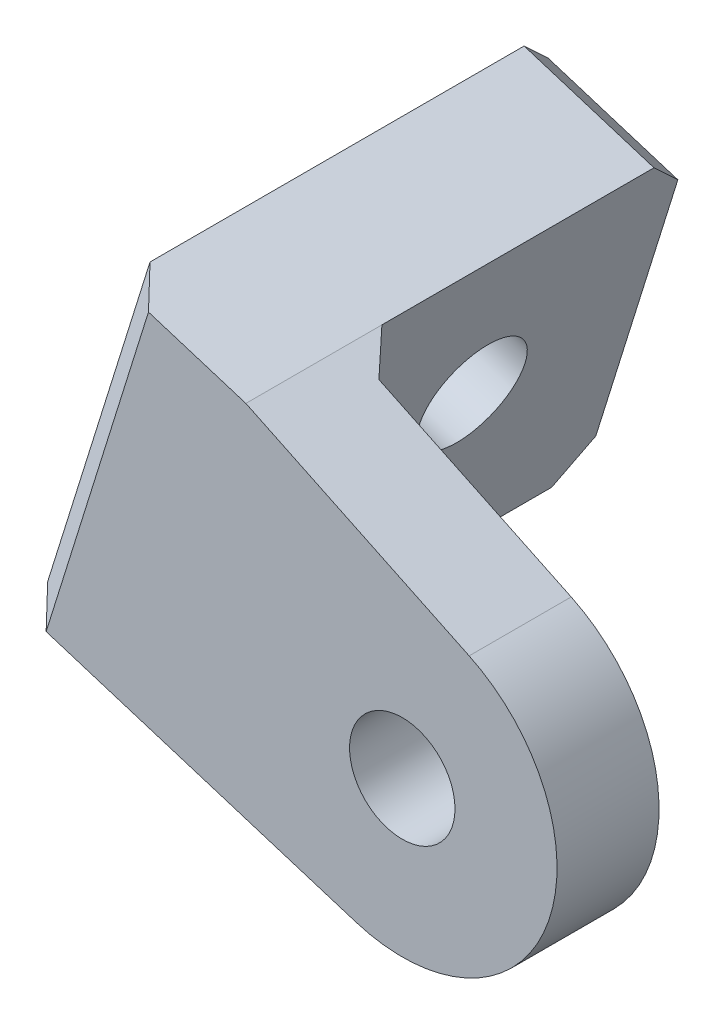
ISO-10303-21;
HEADER;
FILE_DESCRIPTION(('STEP AP214'),'2;1');
FILE_NAME('part.step','',(''),(''),'','','');
FILE_SCHEMA(('AUTOMOTIVE_DESIGN { 1 0 10303 214 1 1 1 1 }'));
ENDSEC;
DATA;
#1=APPLICATION_CONTEXT('core data for automotive mechanical design processes');
#2=APPLICATION_PROTOCOL_DEFINITION('international standard','automotive_design',2000,#1);
#3=PRODUCT_CONTEXT('',#1,'mechanical');
#4=PRODUCT('Part','Part','',(#3));
#5=PRODUCT_RELATED_PRODUCT_CATEGORY('part','',(#4));
#6=PRODUCT_DEFINITION_FORMATION('','',#4);
#7=PRODUCT_DEFINITION_CONTEXT('part definition',#1,'design');
#8=PRODUCT_DEFINITION('design','',#6,#7);
#9=PRODUCT_DEFINITION_SHAPE('','',#8);
#10=(LENGTH_UNIT() NAMED_UNIT(*) SI_UNIT(.MILLI.,.METRE.));
#11=(NAMED_UNIT(*) PLANE_ANGLE_UNIT() SI_UNIT($,.RADIAN.));
#12=(NAMED_UNIT(*) SI_UNIT($,.STERADIAN.) SOLID_ANGLE_UNIT());
#13=UNCERTAINTY_MEASURE_WITH_UNIT(LENGTH_MEASURE(1.E-05),#10,'distance_accuracy_value','');
#14=(GEOMETRIC_REPRESENTATION_CONTEXT(3) GLOBAL_UNCERTAINTY_ASSIGNED_CONTEXT((#13)) GLOBAL_UNIT_ASSIGNED_CONTEXT((#10,
#11,#12)) REPRESENTATION_CONTEXT('',''));
#15=CARTESIAN_POINT('',(0.,0.,0.));
#16=DIRECTION('',(0.,0.,1.));
#17=DIRECTION('',(1.,0.,0.));
#18=AXIS2_PLACEMENT_3D('',#15,#16,#17);
#19=CARTESIAN_POINT('',(12.6458721758377,26.3905196953717,-3.));
#20=DIRECTION('',(0.432131708683439,0.90181050467952,0.));
#21=DIRECTION('',(-0.90181050467952,0.43213170868344,0.));
#22=AXIS2_PLACEMENT_3D('',#19,#20,#21);
#23=PLANE('',#22);
#24=DIRECTION('',(0.90181050467952,-0.432131708683439,0.));
#25=VECTOR('',#24,1.);
#26=CARTESIAN_POINT('',(12.6458721758377,26.3905196953717,0.));
#27=LINE('',#26,#25);
#28=CARTESIAN_POINT('',(2.67565379619653,31.1680727200756,0.));
#29=VERTEX_POINT('',#28);
#30=CARTESIAN_POINT('',(9.24108820924442,28.0220321977735,0.));
#31=VERTEX_POINT('',#30);
#32=EDGE_CURVE('E158',#29,#31,#27,.T.);
#33=ORIENTED_EDGE('',*,*,#32,.T.);
#34=DIRECTION('',(0.,0.,1.));
#35=VECTOR('',#34,1.);
#36=CARTESIAN_POINT('',(9.24108820924442,28.0220321977735,-3.));
#37=LINE('',#36,#35);
#38=CARTESIAN_POINT('',(9.24108820924442,28.0220321977735,-3.));
#39=VERTEX_POINT('',#38);
#40=EDGE_CURVE('E137',#39,#31,#37,.T.);
#41=ORIENTED_EDGE('',*,*,#40,.F.);
#42=DIRECTION('',(0.90181050467952,-0.432131708683439,0.));
#43=VECTOR('',#42,1.);
#44=CARTESIAN_POINT('',(12.6458721758377,26.3905196953717,-3.));
#45=LINE('',#44,#43);
#46=CARTESIAN_POINT('',(3.58694323926157,30.7313988710868,-3.));
#47=VERTEX_POINT('',#46);
#48=EDGE_CURVE('E125',#47,#39,#45,.T.);
#49=ORIENTED_EDGE('',*,*,#48,.F.);
#50=DIRECTION('',(0.64100135330547,-0.307156557430796,0.703400394006016));
#51=VECTOR('',#50,1.);
#52=CARTESIAN_POINT('',(3.33765436171891,30.8508537100461,-3.27355620043639));
#53=LINE('',#52,#51);
#54=CARTESIAN_POINT('',(2.67565379619653,31.1680727200756,-4.00000000000001));
#55=VERTEX_POINT('',#54);
#56=EDGE_CURVE('E207',#55,#47,#53,.T.);
#57=ORIENTED_EDGE('',*,*,#56,.F.);
#58=DIRECTION('',(0.,0.,1.));
#59=VECTOR('',#58,1.);
#60=CARTESIAN_POINT('',(2.67565379619653,31.1680727200756,-3.));
#61=LINE('',#60,#59);
#62=EDGE_CURVE('E149',#55,#29,#61,.T.);
#63=ORIENTED_EDGE('',*,*,#62,.T.);
#64=EDGE_LOOP('',(#33,#41,#49,#57,#63));
#65=FACE_BOUND('',#64,.T.);
#66=ADVANCED_FACE('F37',(#65),#23,.T.);
#67=CARTESIAN_POINT('',(9.10096871201294,29.1629022647186,-3.));
#68=DIRECTION('',(0.297904049493287,0.954595818813125,0.));
#69=DIRECTION('',(-0.954595818813125,0.297904049493287,0.));
#70=AXIS2_PLACEMENT_3D('',#67,#68,#69);
#71=PLANE('',#70);
#72=DIRECTION('',(0.954595818813125,-0.297904049493287,0.));
#73=VECTOR('',#72,1.);
#74=CARTESIAN_POINT('',(9.10096871201294,29.1629022647186,0.));
#75=LINE('',#74,#73);
#76=CARTESIAN_POINT('',(-0.188133660242845,32.0617848685554,0.));
#77=VERTEX_POINT('',#76);
#78=EDGE_CURVE('E161',#77,#29,#75,.T.);
#79=ORIENTED_EDGE('',*,*,#78,.T.);
#80=ORIENTED_EDGE('',*,*,#62,.F.);
#81=DIRECTION('',(0.,0.,1.));
#82=VECTOR('',#81,1.);
#83=CARTESIAN_POINT('',(2.67565379619653,31.1680727200756,-13.));
#84=LINE('',#83,#82);
#85=CARTESIAN_POINT('',(2.67565379619653,31.1680727200756,-12.));
#86=VERTEX_POINT('',#85);
#87=EDGE_CURVE('E189',#86,#55,#84,.T.);
#88=ORIENTED_EDGE('',*,*,#87,.F.);
#89=DIRECTION('',(0.954595818813125,-0.297904049493287,0.));
#90=VECTOR('',#89,1.);
#91=CARTESIAN_POINT('',(9.10096871201294,29.1629022647186,-12.));
#92=LINE('',#91,#90);
#93=CARTESIAN_POINT('',(-1.14272947905597,32.3596889180487,-12.));
#94=VERTEX_POINT('',#93);
#95=EDGE_CURVE('E200',#94,#86,#92,.T.);
#96=ORIENTED_EDGE('',*,*,#95,.F.);
#97=DIRECTION('',(0.,0.,1.));
#98=VECTOR('',#97,1.);
#99=CARTESIAN_POINT('',(-1.14272947905597,32.3596889180487,-3.));
#100=LINE('',#99,#98);
#101=CARTESIAN_POINT('',(-1.14272947905597,32.3596889180487,-1.));
#102=VERTEX_POINT('',#101);
#103=EDGE_CURVE('E170',#94,#102,#100,.T.);
#104=ORIENTED_EDGE('',*,*,#103,.T.);
#105=DIRECTION('',(-0.675001176775085,0.210649973539636,-0.707106781186549));
#106=VECTOR('',#105,1.);
#107=CARTESIAN_POINT('',(3.02452379766534,31.059199640877,3.36546357588553));
#108=LINE('',#107,#106);
#109=EDGE_CURVE('E213',#77,#102,#108,.T.);
#110=ORIENTED_EDGE('',*,*,#109,.F.);
#111=EDGE_LOOP('',(#79,#80,#88,#96,#104,#110));
#112=FACE_BOUND('',#111,.T.);
#113=ADVANCED_FACE('F235',(#112),#71,.T.);
#114=CARTESIAN_POINT('',(-10.2436981910689,3.19678665333007,-3.));
#115=DIRECTION('',(-0.954595818813125,0.297904049493287,0.));
#116=DIRECTION('',(-0.297904049493287,-0.954595818813125,0.));
#117=AXIS2_PLACEMENT_3D('',#114,#115,#116);
#118=PLANE('',#117);
#119=CARTESIAN_POINT('',(-2.54058132704005,27.8804496070172,-8.05588909029522));
#120=DIRECTION('',(0.954595818813125,-0.297904049493287,0.));
#121=DIRECTION('',(-3.01133376189992E-12,-9.64943787454371E-12,1.));
#122=AXIS2_PLACEMENT_3D('',#119,#120,#121);
#123=ELLIPSE('',#122,1.55,1.54999119407382);
#124=CARTESIAN_POINT('',(-2.54058132704471,27.8804496070023,-6.50588909029522));
#125=VERTEX_POINT('',#124);
#126=EDGE_CURVE('E244',#125,#125,#123,.T.);
#127=ORIENTED_EDGE('',*,*,#126,.T.);
#128=EDGE_LOOP('',(#127));
#129=FACE_BOUND('',#128,.T.);
#130=ORIENTED_EDGE('',*,*,#103,.F.);
#131=DIRECTION('',(-0.210649973539637,-0.675001176775088,-0.707106781186546));
#132=VECTOR('',#131,1.);
#133=CARTESIAN_POINT('',(-4.35264561234267,22.0739189703484,-22.7749999999883));
#134=LINE('',#133,#132);
#135=CARTESIAN_POINT('',(-1.44063352854926,31.4050930992356,-13.));
#136=VERTEX_POINT('',#135);
#137=EDGE_CURVE('E195',#136,#94,#134,.F.);
#138=ORIENTED_EDGE('',*,*,#137,.F.);
#139=DIRECTION('',(-0.297904049493287,-0.954595818813125,0.));
#140=VECTOR('',#139,1.);
#141=CARTESIAN_POINT('',(-1.14272947905597,32.3596889180487,-13.));
#142=LINE('',#141,#140);
#143=CARTESIAN_POINT('',(-3.85365632944488,23.6728669668493,-13.));
#144=VERTEX_POINT('',#143);
#145=EDGE_CURVE('E237',#136,#144,#142,.T.);
#146=ORIENTED_EDGE('',*,*,#145,.T.);
#147=DIRECTION('',(-0.210649973539636,-0.675001176775085,0.707106781186548));
#148=VECTOR('',#147,1.);
#149=CARTESIAN_POINT('',(-8.53819750772333,8.66184771602406,2.72499999998831));
#150=LINE('',#149,#148);
#151=CARTESIAN_POINT('',(-4.15156037893817,22.7182711480361,-12.));
#152=VERTEX_POINT('',#151);
#153=EDGE_CURVE('E197',#152,#144,#150,.F.);
#154=ORIENTED_EDGE('',*,*,#153,.F.);
#155=DIRECTION('',(0.,0.,1.));
#156=VECTOR('',#155,1.);
#157=CARTESIAN_POINT('',(-4.15156037893816,22.7182711480361,-3.));
#158=LINE('',#157,#156);
#159=CARTESIAN_POINT('',(-4.15156037893816,22.7182711480361,-1.));
#160=VERTEX_POINT('',#159);
#161=EDGE_CURVE('E136',#152,#160,#158,.T.);
#162=ORIENTED_EDGE('',*,*,#161,.T.);
#163=DIRECTION('',(-0.297904049493287,-0.954595818813125,0.));
#164=VECTOR('',#163,1.);
#165=CARTESIAN_POINT('',(-4.15156037893817,22.7182711480361,-1.));
#166=LINE('',#165,#164);
#167=EDGE_CURVE('E45',#102,#160,#166,.T.);
#168=ORIENTED_EDGE('',*,*,#167,.F.);
#169=EDGE_LOOP('',(#130,#138,#146,#154,#162,#168));
#170=FACE_BOUND('',#169,.T.);
#171=ADVANCED_FACE('F216',(#129,#170),#118,.T.);
#172=CARTESIAN_POINT('',(6.09213781213073,19.5214844947061,-3.));
#173=DIRECTION('',(-0.297904049493286,-0.954595818813125,0.));
#174=DIRECTION('',(0.954595818813126,-0.297904049493286,0.));
#175=AXIS2_PLACEMENT_3D('',#172,#173,#174);
#176=PLANE('',#175);
#177=ORIENTED_EDGE('',*,*,#161,.F.);
#178=DIRECTION('',(-0.954595818813126,0.297904049493286,0.));
#179=VECTOR('',#178,1.);
#180=CARTESIAN_POINT('',(6.09213781213073,19.5214844947061,-12.));
#181=LINE('',#180,#179);
#182=CARTESIAN_POINT('',(-0.333177103685661,21.526654950063,-12.));
#183=VERTEX_POINT('',#182);
#184=EDGE_CURVE('E193',#183,#152,#181,.T.);
#185=ORIENTED_EDGE('',*,*,#184,.F.);
#186=DIRECTION('',(0.,0.,1.));
#187=VECTOR('',#186,1.);
#188=CARTESIAN_POINT('',(-0.333177103685661,21.526654950063,-13.));
#189=LINE('',#188,#187);
#190=CARTESIAN_POINT('',(-0.333177103685661,21.526654950063,-4.00000000000001));
#191=VERTEX_POINT('',#190);
#192=EDGE_CURVE('E162',#183,#191,#189,.T.);
#193=ORIENTED_EDGE('',*,*,#192,.T.);
#194=DIRECTION('',(-0.675001176775082,0.210649973539634,-0.707106781186551));
#195=VECTOR('',#194,1.);
#196=CARTESIAN_POINT('',(-0.333177103685662,21.526654950063,-4.00000000000001));
#197=LINE('',#196,#195);
#198=CARTESIAN_POINT('',(0.621418715127459,21.2287509005697,-3.));
#199=VERTEX_POINT('',#198);
#200=EDGE_CURVE('E142',#199,#191,#197,.T.);
#201=ORIENTED_EDGE('',*,*,#200,.F.);
#202=DIRECTION('',(-0.954595818813126,0.297904049493286,0.));
#203=VECTOR('',#202,1.);
#204=CARTESIAN_POINT('',(6.09213781213073,19.5214844947061,-3.));
#205=LINE('',#204,#203);
#206=CARTESIAN_POINT('',(5.91942550954031,19.575383425882,-3.));
#207=VERTEX_POINT('',#206);
#208=EDGE_CURVE('E122',#207,#199,#205,.T.);
#209=ORIENTED_EDGE('',*,*,#208,.F.);
#210=DIRECTION('',(0.,0.,1.));
#211=VECTOR('',#210,1.);
#212=CARTESIAN_POINT('',(5.91942550954031,19.575383425882,-3.));
#213=LINE('',#212,#211);
#214=CARTESIAN_POINT('',(5.91942550954031,19.575383425882,0.));
#215=VERTEX_POINT('',#214);
#216=EDGE_CURVE('E132',#207,#215,#213,.T.);
#217=ORIENTED_EDGE('',*,*,#216,.T.);
#218=DIRECTION('',(-0.954595818813126,0.297904049493286,0.));
#219=VECTOR('',#218,1.);
#220=CARTESIAN_POINT('',(6.09213781213073,19.5214844947061,0.));
#221=LINE('',#220,#219);
#222=CARTESIAN_POINT('',(-3.19696456012504,22.4203670985429,0.));
#223=VERTEX_POINT('',#222);
#224=EDGE_CURVE('E164',#215,#223,#221,.T.);
#225=ORIENTED_EDGE('',*,*,#224,.T.);
#226=DIRECTION('',(0.675001176775085,-0.210649973539635,0.707106781186549));
#227=VECTOR('',#226,1.);
#228=CARTESIAN_POINT('',(0.0156928977831389,21.4177818708644,3.36546357588553));
#229=LINE('',#228,#227);
#230=EDGE_CURVE('E11',#160,#223,#229,.T.);
#231=ORIENTED_EDGE('',*,*,#230,.F.);
#232=EDGE_LOOP('',(#177,#185,#193,#201,#209,#217,#225,#231));
#233=FACE_BOUND('',#232,.T.);
#234=ADVANCED_FACE('F139',(#233),#176,.T.);
#235=CARTESIAN_POINT('',(7.27488893473476,23.9187944014817,-3.));
#236=DIRECTION('',(0.,0.,1.));
#237=DIRECTION('',(-1.,0.,0.));
#238=AXIS2_PLACEMENT_3D('',#235,#236,#237);
#239=CYLINDRICAL_SURFACE('',#238,4.55);
#240=CARTESIAN_POINT('',(7.27488893473476,23.9187944014817,0.));
#241=DIRECTION('',(0.,0.,1.));
#242=DIRECTION('',(1.,0.,0.));
#243=AXIS2_PLACEMENT_3D('',#240,#241,#242);
#244=CIRCLE('',#243,4.55);
#245=EDGE_CURVE('E134',#215,#31,#244,.T.);
#246=ORIENTED_EDGE('',*,*,#245,.F.);
#247=ORIENTED_EDGE('',*,*,#216,.F.);
#248=CARTESIAN_POINT('',(7.27488893473476,23.9187944014817,-3.));
#249=DIRECTION('',(0.,0.,1.));
#250=DIRECTION('',(1.,0.,0.));
#251=AXIS2_PLACEMENT_3D('',#248,#249,#250);
#252=CIRCLE('',#251,4.55);
#253=EDGE_CURVE('E117',#207,#39,#252,.T.);
#254=ORIENTED_EDGE('',*,*,#253,.T.);
#255=ORIENTED_EDGE('',*,*,#40,.T.);
#256=EDGE_LOOP('',(#246,#247,#254,#255));
#257=FACE_BOUND('',#256,.T.);
#258=ADVANCED_FACE('F133',(#257),#239,.T.);
#259=CARTESIAN_POINT('',(7.27488893473476,23.9187944014817,-3.));
#260=DIRECTION('',(0.,0.,1.));
#261=DIRECTION('',(-1.,0.,0.));
#262=AXIS2_PLACEMENT_3D('',#259,#260,#261);
#263=CYLINDRICAL_SURFACE('',#262,1.55);
#264=CARTESIAN_POINT('',(7.27488893473476,23.9187944014817,-3.));
#265=DIRECTION('',(0.,0.,1.));
#266=DIRECTION('',(1.,0.,0.));
#267=AXIS2_PLACEMENT_3D('',#264,#265,#266);
#268=CIRCLE('',#267,1.55);
#269=CARTESIAN_POINT('',(8.82488893473476,23.9187944014817,-3.));
#270=VERTEX_POINT('',#269);
#271=EDGE_CURVE('E129',#270,#270,#268,.T.);
#272=ORIENTED_EDGE('',*,*,#271,.F.);
#273=EDGE_LOOP('',(#272));
#274=FACE_BOUND('',#273,.T.);
#275=CARTESIAN_POINT('',(7.27488893473476,23.9187944014817,0.));
#276=DIRECTION('',(0.,0.,1.));
#277=DIRECTION('',(1.,0.,0.));
#278=AXIS2_PLACEMENT_3D('',#275,#276,#277);
#279=CIRCLE('',#278,1.55);
#280=CARTESIAN_POINT('',(8.82488893473476,23.9187944014817,0.));
#281=VERTEX_POINT('',#280);
#282=EDGE_CURVE('E144',#281,#281,#279,.T.);
#283=ORIENTED_EDGE('',*,*,#282,.T.);
#284=EDGE_LOOP('',(#283));
#285=FACE_BOUND('',#284,.T.);
#286=ADVANCED_FACE('F262',(#274,#285),#263,.F.);
#287=CARTESIAN_POINT('',(0.,0.,-3.));
#288=DIRECTION('',(0.,0.,-1.));
#289=DIRECTION('',(1.,0.,0.));
#290=AXIS2_PLACEMENT_3D('',#287,#288,#289);
#291=PLANE('',#290);
#292=ORIENTED_EDGE('',*,*,#48,.T.);
#293=ORIENTED_EDGE('',*,*,#253,.F.);
#294=ORIENTED_EDGE('',*,*,#208,.T.);
#295=DIRECTION('',(-0.297904049493286,-0.954595818813126,0.));
#296=VECTOR('',#295,1.);
#297=CARTESIAN_POINT('',(-5.47071909700327,1.70726640586362,-3.));
#298=LINE('',#297,#296);
#299=EDGE_CURVE('E205',#47,#199,#298,.T.);
#300=ORIENTED_EDGE('',*,*,#299,.F.);
#301=EDGE_LOOP('',(#292,#293,#294,#300));
#302=FACE_BOUND('',#301,.T.);
#303=ORIENTED_EDGE('',*,*,#271,.T.);
#304=EDGE_LOOP('',(#303));
#305=FACE_BOUND('',#304,.T.);
#306=ADVANCED_FACE('F119',(#302,#305),#291,.T.);
#307=CARTESIAN_POINT('',(0.,0.,0.));
#308=DIRECTION('',(0.,0.,-1.));
#309=DIRECTION('',(1.,0.,0.));
#310=AXIS2_PLACEMENT_3D('',#307,#308,#309);
#311=PLANE('',#310);
#312=ORIENTED_EDGE('',*,*,#224,.F.);
#313=ORIENTED_EDGE('',*,*,#245,.T.);
#314=ORIENTED_EDGE('',*,*,#32,.F.);
#315=ORIENTED_EDGE('',*,*,#78,.F.);
#316=DIRECTION('',(0.297904049493287,0.954595818813125,0.));
#317=VECTOR('',#316,1.);
#318=CARTESIAN_POINT('',(-0.188133660242844,32.0617848685554,0.));
#319=LINE('',#318,#317);
#320=EDGE_CURVE('E211',#223,#77,#319,.T.);
#321=ORIENTED_EDGE('',*,*,#320,.F.);
#322=EDGE_LOOP('',(#312,#313,#314,#315,#321));
#323=FACE_BOUND('',#322,.T.);
#324=ORIENTED_EDGE('',*,*,#282,.F.);
#325=EDGE_LOOP('',(#324));
#326=FACE_BOUND('',#325,.T.);
#327=ADVANCED_FACE('F233',(#323,#326),#311,.F.);
#328=CARTESIAN_POINT('',(-0.333177103685661,21.526654950063,-13.));
#329=DIRECTION('',(-0.954595818813125,0.297904049493286,0.));
#330=DIRECTION('',(-0.297904049493286,-0.954595818813126,0.));
#331=AXIS2_PLACEMENT_3D('',#328,#329,#330);
#332=PLANE('',#331);
#333=CARTESIAN_POINT('',(1.27780194821246,26.6888334090441,-8.05588909029522));
#334=DIRECTION('',(0.954595818813125,-0.297904049493287,0.));
#335=DIRECTION('',(-3.01133376189992E-12,-9.64943787454371E-12,1.));
#336=AXIS2_PLACEMENT_3D('',#333,#334,#335);
#337=ELLIPSE('',#336,1.55,1.54999119407382);
#338=CARTESIAN_POINT('',(1.27780194820779,26.6888334090291,-6.50588909029522));
#339=VERTEX_POINT('',#338);
#340=EDGE_CURVE('E241',#339,#339,#337,.F.);
#341=ORIENTED_EDGE('',*,*,#340,.T.);
#342=EDGE_LOOP('',(#341));
#343=FACE_BOUND('',#342,.T.);
#344=ORIENTED_EDGE('',*,*,#192,.F.);
#345=DIRECTION('',(0.210649973539635,0.675001176775085,-0.707106781186548));
#346=VECTOR('',#345,1.);
#347=CARTESIAN_POINT('',(-0.0352730541923751,22.4812507688761,-13.));
#348=LINE('',#347,#346);
#349=CARTESIAN_POINT('',(-0.035273054192375,22.4812507688761,-13.));
#350=VERTEX_POINT('',#349);
#351=EDGE_CURVE('E191',#350,#183,#348,.F.);
#352=ORIENTED_EDGE('',*,*,#351,.F.);
#353=DIRECTION('',(0.297904049493286,0.954595818813126,0.));
#354=VECTOR('',#353,1.);
#355=CARTESIAN_POINT('',(-0.333177103685661,21.526654950063,-13.));
#356=LINE('',#355,#354);
#357=CARTESIAN_POINT('',(2.37774974670324,30.2134769012624,-13.));
#358=VERTEX_POINT('',#357);
#359=EDGE_CURVE('E236',#350,#358,#356,.T.);
#360=ORIENTED_EDGE('',*,*,#359,.T.);
#361=DIRECTION('',(0.210649973539636,0.675001176775088,0.707106781186546));
#362=VECTOR('',#361,1.);
#363=CARTESIAN_POINT('',(2.37774974670324,30.2134769012624,-13.));
#364=LINE('',#363,#362);
#365=EDGE_CURVE('E185',#86,#358,#364,.F.);
#366=ORIENTED_EDGE('',*,*,#365,.F.);
#367=ORIENTED_EDGE('',*,*,#87,.T.);
#368=DIRECTION('',(0.297904049493286,0.954595818813126,0.));
#369=VECTOR('',#368,1.);
#370=CARTESIAN_POINT('',(-0.333177103685661,21.526654950063,-4.00000000000001));
#371=LINE('',#370,#369);
#372=EDGE_CURVE('E203',#191,#55,#371,.T.);
#373=ORIENTED_EDGE('',*,*,#372,.F.);
#374=EDGE_LOOP('',(#344,#352,#360,#366,#367,#373));
#375=FACE_BOUND('',#374,.T.);
#376=ADVANCED_FACE('F226',(#343,#375),#332,.F.);
#377=CARTESIAN_POINT('',(0.,0.,-13.));
#378=DIRECTION('',(0.,0.,-1.));
#379=DIRECTION('',(1.,0.,0.));
#380=AXIS2_PLACEMENT_3D('',#377,#378,#379);
#381=PLANE('',#380);
#382=ORIENTED_EDGE('',*,*,#145,.F.);
#383=DIRECTION('',(-0.954595818813125,0.297904049493287,0.));
#384=VECTOR('',#383,1.);
#385=CARTESIAN_POINT('',(8.80306466251966,28.2083064459055,-13.));
#386=LINE('',#385,#384);
#387=EDGE_CURVE('E176',#358,#136,#386,.T.);
#388=ORIENTED_EDGE('',*,*,#387,.F.);
#389=ORIENTED_EDGE('',*,*,#359,.F.);
#390=DIRECTION('',(0.954595818813126,-0.297904049493286,0.));
#391=VECTOR('',#390,1.);
#392=CARTESIAN_POINT('',(6.39004186162402,20.4760803135192,-13.));
#393=LINE('',#392,#391);
#394=EDGE_CURVE('E181',#144,#350,#393,.T.);
#395=ORIENTED_EDGE('',*,*,#394,.F.);
#396=EDGE_LOOP('',(#382,#388,#389,#395));
#397=FACE_BOUND('',#396,.T.);
#398=ADVANCED_FACE('F252',(#397),#381,.T.);
#399=CARTESIAN_POINT('',(12.9717218675151,23.0394709985301,-8.05588909029522));
#400=DIRECTION('',(0.954595818813125,-0.297904049493287,0.));
#401=DIRECTION('',(-3.01133376189992E-12,-9.64943787454371E-12,1.));
#402=AXIS2_PLACEMENT_3D('',#399,#400,#401);
#403=ELLIPSE('',#402,1.55,1.54999119407382);
#404=DIRECTION('',(-0.954595818813125,0.297904049493287,0.));
#405=VECTOR('',#404,1.);
#406=SURFACE_OF_LINEAR_EXTRUSION('',#403,#405);
#407=ORIENTED_EDGE('',*,*,#126,.F.);
#408=EDGE_LOOP('',(#407));
#409=FACE_BOUND('',#408,.T.);
#410=ORIENTED_EDGE('',*,*,#340,.F.);
#411=EDGE_LOOP('',(#410));
#412=FACE_BOUND('',#411,.T.);
#413=ADVANCED_FACE('F249',(#409,#412),#406,.T.);
#414=CARTESIAN_POINT('',(6.39004186162402,20.4760803135192,-13.));
#415=DIRECTION('',(0.210649973539636,0.675001176775087,0.707106781186547));
#416=DIRECTION('',(0.954595818813126,-0.297904049493286,0.));
#417=AXIS2_PLACEMENT_3D('',#414,#415,#416);
#418=PLANE('',#417);
#419=ORIENTED_EDGE('',*,*,#153,.T.);
#420=ORIENTED_EDGE('',*,*,#394,.T.);
#421=ORIENTED_EDGE('',*,*,#351,.T.);
#422=ORIENTED_EDGE('',*,*,#184,.T.);
#423=EDGE_LOOP('',(#419,#420,#421,#422));
#424=FACE_BOUND('',#423,.T.);
#425=ADVANCED_FACE('F221',(#424),#418,.F.);
#426=CARTESIAN_POINT('',(8.80306466251965,28.2083064459055,-13.));
#427=DIRECTION('',(-0.210649973539635,-0.675001176775084,0.707106781186549));
#428=DIRECTION('',(-0.954595818813125,0.297904049493287,0.));
#429=AXIS2_PLACEMENT_3D('',#426,#427,#428);
#430=PLANE('',#429);
#431=ORIENTED_EDGE('',*,*,#365,.T.);
#432=ORIENTED_EDGE('',*,*,#387,.T.);
#433=ORIENTED_EDGE('',*,*,#137,.T.);
#434=ORIENTED_EDGE('',*,*,#95,.T.);
#435=EDGE_LOOP('',(#431,#432,#433,#434));
#436=FACE_BOUND('',#435,.T.);
#437=ADVANCED_FACE('F281',(#436),#430,.F.);
#438=CARTESIAN_POINT('',(-0.333177103685661,21.526654950063,-4.00000000000001));
#439=DIRECTION('',(-0.67500117677509,0.210649973539637,0.707106781186543));
#440=DIRECTION('',(0.297904049493286,0.954595818813126,0.));
#441=AXIS2_PLACEMENT_3D('',#438,#439,#440);
#442=PLANE('',#441);
#443=ORIENTED_EDGE('',*,*,#200,.T.);
#444=ORIENTED_EDGE('',*,*,#372,.T.);
#445=ORIENTED_EDGE('',*,*,#56,.T.);
#446=ORIENTED_EDGE('',*,*,#299,.T.);
#447=EDGE_LOOP('',(#443,#444,#445,#446));
#448=FACE_BOUND('',#447,.T.);
#449=ADVANCED_FACE('F230',(#448),#442,.F.);
#450=CARTESIAN_POINT('',(-9.28910237225579,2.89888260383678,0.));
#451=DIRECTION('',(-0.675001176775087,0.210649973539637,0.707106781186546));
#452=DIRECTION('',(-0.297904049493287,-0.954595818813125,0.));
#453=AXIS2_PLACEMENT_3D('',#450,#451,#452);
#454=PLANE('',#453);
#455=ORIENTED_EDGE('',*,*,#230,.T.);
#456=ORIENTED_EDGE('',*,*,#320,.T.);
#457=ORIENTED_EDGE('',*,*,#109,.T.);
#458=ORIENTED_EDGE('',*,*,#167,.T.);
#459=EDGE_LOOP('',(#455,#456,#457,#458));
#460=FACE_BOUND('',#459,.T.);
#461=ADVANCED_FACE('F39',(#460),#454,.T.);
#462=CLOSED_SHELL('',(#66,#113,#171,#234,#258,#286,#306,#327,#376,#398,#413,#425,#437,#449,#461));
#463=MANIFOLD_SOLID_BREP('B2',#462);
#464=ADVANCED_BREP_SHAPE_REPRESENTATION('',(#18,#463),#14);
#465=SHAPE_DEFINITION_REPRESENTATION(#9,#464);
ENDSEC;
END-ISO-10303-21;
